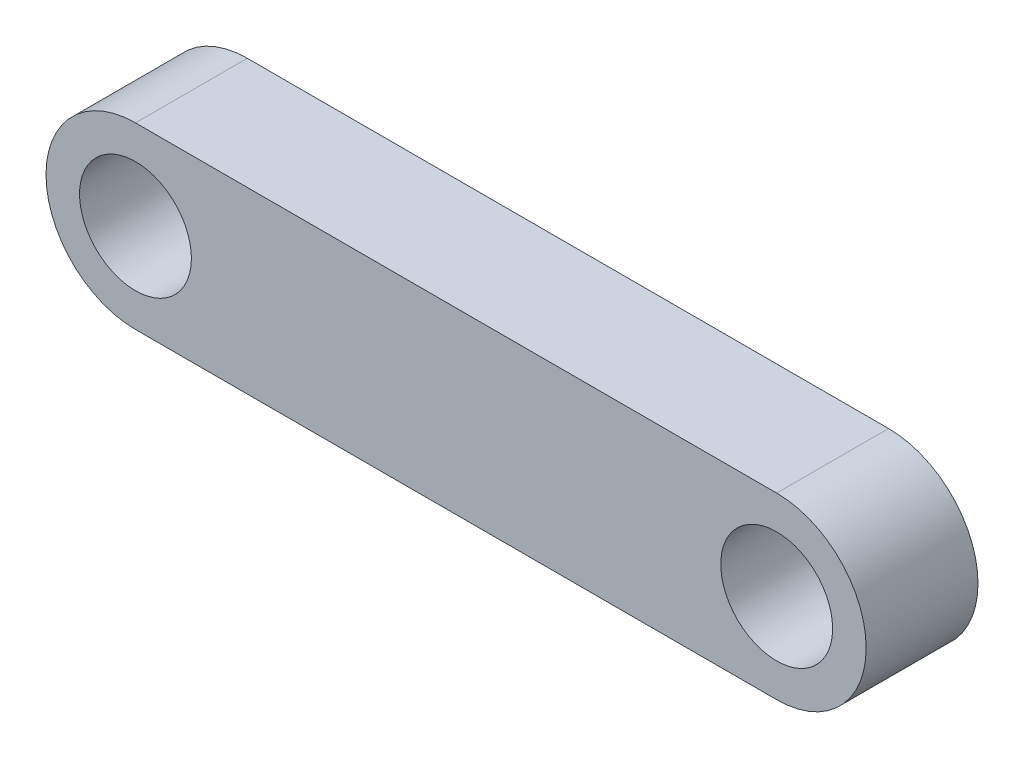
ISO-10303-21;
HEADER;
FILE_DESCRIPTION(('STEP AP214'),'2;1');
FILE_NAME('part.step','',(''),(''),'','','');
FILE_SCHEMA(('AUTOMOTIVE_DESIGN { 1 0 10303 214 1 1 1 1 }'));
ENDSEC;
DATA;
#1=APPLICATION_CONTEXT('core data for automotive mechanical design processes');
#2=APPLICATION_PROTOCOL_DEFINITION('international standard','automotive_design',2000,#1);
#3=PRODUCT_CONTEXT('',#1,'mechanical');
#4=PRODUCT('Part','Part','',(#3));
#5=PRODUCT_RELATED_PRODUCT_CATEGORY('part','',(#4));
#6=PRODUCT_DEFINITION_FORMATION('','',#4);
#7=PRODUCT_DEFINITION_CONTEXT('part definition',#1,'design');
#8=PRODUCT_DEFINITION('design','',#6,#7);
#9=PRODUCT_DEFINITION_SHAPE('','',#8);
#10=(LENGTH_UNIT() NAMED_UNIT(*) SI_UNIT(.MILLI.,.METRE.));
#11=(NAMED_UNIT(*) PLANE_ANGLE_UNIT() SI_UNIT($,.RADIAN.));
#12=(NAMED_UNIT(*) SI_UNIT($,.STERADIAN.) SOLID_ANGLE_UNIT());
#13=UNCERTAINTY_MEASURE_WITH_UNIT(LENGTH_MEASURE(1.E-05),#10,'distance_accuracy_value','');
#14=(GEOMETRIC_REPRESENTATION_CONTEXT(3) GLOBAL_UNCERTAINTY_ASSIGNED_CONTEXT((#13)) GLOBAL_UNIT_ASSIGNED_CONTEXT((#10,
#11,#12)) REPRESENTATION_CONTEXT('',''));
#15=CARTESIAN_POINT('',(0.,0.,0.));
#16=DIRECTION('',(0.,0.,1.));
#17=DIRECTION('',(1.,0.,0.));
#18=AXIS2_PLACEMENT_3D('',#15,#16,#17);
#19=CARTESIAN_POINT('',(-19.3325626510137,33.7870930752289,3.));
#20=DIRECTION('',(0.,0.,1.));
#21=DIRECTION('',(1.,0.,0.));
#22=AXIS2_PLACEMENT_3D('',#19,#20,#21);
#23=PLANE('',#22);
#24=CARTESIAN_POINT('',(-19.3325626510137,33.7870930752289,3.));
#25=DIRECTION('',(0.,0.,1.));
#26=DIRECTION('',(1.,0.,0.));
#27=AXIS2_PLACEMENT_3D('',#24,#25,#26);
#28=CIRCLE('',#27,1.5);
#29=CARTESIAN_POINT('',(-17.8325626510137,33.7870930752289,3.));
#30=VERTEX_POINT('',#29);
#31=EDGE_CURVE('E106',#30,#30,#28,.T.);
#32=ORIENTED_EDGE('',*,*,#31,.F.);
#33=EDGE_LOOP('',(#32));
#34=FACE_BOUND('',#33,.T.);
#35=CARTESIAN_POINT('',(-19.3325626510137,33.7870930752289,3.));
#36=DIRECTION('',(0.,0.,1.));
#37=DIRECTION('',(1.,0.,0.));
#38=AXIS2_PLACEMENT_3D('',#35,#36,#37);
#39=CIRCLE('',#38,2.4);
#40=CARTESIAN_POINT('',(-19.3325626510137,36.1870930752289,3.));
#41=VERTEX_POINT('',#40);
#42=CARTESIAN_POINT('',(-19.3325626510137,31.3870930752289,3.));
#43=VERTEX_POINT('',#42);
#44=EDGE_CURVE('E91',#41,#43,#39,.T.);
#45=ORIENTED_EDGE('',*,*,#44,.T.);
#46=DIRECTION('',(1.,0.,0.));
#47=VECTOR('',#46,1.);
#48=CARTESIAN_POINT('',(-19.3325626510137,31.3870930752289,3.));
#49=LINE('',#48,#47);
#50=CARTESIAN_POINT('',(-2.13290124671727,31.3870930752289,3.));
#51=VERTEX_POINT('',#50);
#52=EDGE_CURVE('E86',#43,#51,#49,.T.);
#53=ORIENTED_EDGE('',*,*,#52,.T.);
#54=CARTESIAN_POINT('',(-2.13290124671726,33.7870930752289,3.));
#55=DIRECTION('',(0.,0.,1.));
#56=DIRECTION('',(1.,0.,0.));
#57=AXIS2_PLACEMENT_3D('',#54,#55,#56);
#58=CIRCLE('',#57,2.4);
#59=CARTESIAN_POINT('',(-2.13290124671727,36.1870930752289,3.));
#60=VERTEX_POINT('',#59);
#61=EDGE_CURVE('E89',#51,#60,#58,.T.);
#62=ORIENTED_EDGE('',*,*,#61,.T.);
#63=DIRECTION('',(-1.,0.,0.));
#64=VECTOR('',#63,1.);
#65=CARTESIAN_POINT('',(-19.3325626510137,36.1870930752289,3.));
#66=LINE('',#65,#64);
#67=EDGE_CURVE('E56',#60,#41,#66,.T.);
#68=ORIENTED_EDGE('',*,*,#67,.T.);
#69=EDGE_LOOP('',(#45,#53,#62,#68));
#70=FACE_BOUND('',#69,.T.);
#71=CARTESIAN_POINT('',(-2.13290124671726,33.7870930752289,3.));
#72=DIRECTION('',(0.,0.,1.));
#73=DIRECTION('',(1.,0.,0.));
#74=AXIS2_PLACEMENT_3D('',#71,#72,#73);
#75=CIRCLE('',#74,1.5);
#76=CARTESIAN_POINT('',(-0.632901246717259,33.7870930752289,3.));
#77=VERTEX_POINT('',#76);
#78=EDGE_CURVE('E121',#77,#77,#75,.T.);
#79=ORIENTED_EDGE('',*,*,#78,.F.);
#80=EDGE_LOOP('',(#79));
#81=FACE_BOUND('',#80,.T.);
#82=ADVANCED_FACE('F39',(#34,#70,#81),#23,.T.);
#83=CARTESIAN_POINT('',(-19.3325626510137,33.7870930752289,0.));
#84=DIRECTION('',(0.,0.,1.));
#85=DIRECTION('',(1.,0.,0.));
#86=AXIS2_PLACEMENT_3D('',#83,#84,#85);
#87=PLANE('',#86);
#88=CARTESIAN_POINT('',(-19.3325626510137,33.7870930752289,0.));
#89=DIRECTION('',(0.,0.,1.));
#90=DIRECTION('',(1.,0.,0.));
#91=AXIS2_PLACEMENT_3D('',#88,#89,#90);
#92=CIRCLE('',#91,1.5);
#93=CARTESIAN_POINT('',(-17.8325626510137,33.7870930752289,0.));
#94=VERTEX_POINT('',#93);
#95=EDGE_CURVE('E118',#94,#94,#92,.T.);
#96=ORIENTED_EDGE('',*,*,#95,.T.);
#97=EDGE_LOOP('',(#96));
#98=FACE_BOUND('',#97,.T.);
#99=CARTESIAN_POINT('',(-19.3325626510137,33.7870930752289,0.));
#100=DIRECTION('',(0.,0.,1.));
#101=DIRECTION('',(1.,0.,0.));
#102=AXIS2_PLACEMENT_3D('',#99,#100,#101);
#103=CIRCLE('',#102,2.4);
#104=CARTESIAN_POINT('',(-19.3325626510137,36.1870930752289,0.));
#105=VERTEX_POINT('',#104);
#106=CARTESIAN_POINT('',(-19.3325626510137,31.3870930752289,0.));
#107=VERTEX_POINT('',#106);
#108=EDGE_CURVE('E103',#105,#107,#103,.T.);
#109=ORIENTED_EDGE('',*,*,#108,.F.);
#110=DIRECTION('',(-1.,0.,0.));
#111=VECTOR('',#110,1.);
#112=CARTESIAN_POINT('',(-19.3325626510137,36.1870930752289,0.));
#113=LINE('',#112,#111);
#114=CARTESIAN_POINT('',(-2.13290124671727,36.1870930752289,0.));
#115=VERTEX_POINT('',#114);
#116=EDGE_CURVE('E79',#115,#105,#113,.T.);
#117=ORIENTED_EDGE('',*,*,#116,.F.);
#118=CARTESIAN_POINT('',(-2.13290124671726,33.7870930752289,0.));
#119=DIRECTION('',(0.,0.,1.));
#120=DIRECTION('',(1.,0.,0.));
#121=AXIS2_PLACEMENT_3D('',#118,#119,#120);
#122=CIRCLE('',#121,2.4);
#123=CARTESIAN_POINT('',(-2.13290124671727,31.3870930752289,0.));
#124=VERTEX_POINT('',#123);
#125=EDGE_CURVE('E73',#124,#115,#122,.T.);
#126=ORIENTED_EDGE('',*,*,#125,.F.);
#127=DIRECTION('',(1.,0.,0.));
#128=VECTOR('',#127,1.);
#129=CARTESIAN_POINT('',(-19.3325626510137,31.3870930752289,0.));
#130=LINE('',#129,#128);
#131=EDGE_CURVE('E95',#107,#124,#130,.T.);
#132=ORIENTED_EDGE('',*,*,#131,.F.);
#133=EDGE_LOOP('',(#109,#117,#126,#132));
#134=FACE_BOUND('',#133,.T.);
#135=CARTESIAN_POINT('',(-2.13290124671726,33.7870930752289,0.));
#136=DIRECTION('',(0.,0.,1.));
#137=DIRECTION('',(1.,0.,0.));
#138=AXIS2_PLACEMENT_3D('',#135,#136,#137);
#139=CIRCLE('',#138,1.5);
#140=CARTESIAN_POINT('',(-0.632901246717259,33.7870930752289,0.));
#141=VERTEX_POINT('',#140);
#142=EDGE_CURVE('E124',#141,#141,#139,.T.);
#143=ORIENTED_EDGE('',*,*,#142,.T.);
#144=EDGE_LOOP('',(#143));
#145=FACE_BOUND('',#144,.T.);
#146=ADVANCED_FACE('F114',(#98,#134,#145),#87,.F.);
#147=CARTESIAN_POINT('',(-19.3325626510137,33.7870930752289,3.));
#148=DIRECTION('',(0.,0.,-1.));
#149=DIRECTION('',(-1.,0.,0.));
#150=AXIS2_PLACEMENT_3D('',#147,#148,#149);
#151=CYLINDRICAL_SURFACE('',#150,2.4);
#152=ORIENTED_EDGE('',*,*,#108,.T.);
#153=DIRECTION('',(0.,0.,-1.));
#154=VECTOR('',#153,1.);
#155=CARTESIAN_POINT('',(-19.3325626510137,31.3870930752289,3.));
#156=LINE('',#155,#154);
#157=EDGE_CURVE('E11',#43,#107,#156,.T.);
#158=ORIENTED_EDGE('',*,*,#157,.F.);
#159=ORIENTED_EDGE('',*,*,#44,.F.);
#160=DIRECTION('',(0.,0.,-1.));
#161=VECTOR('',#160,1.);
#162=CARTESIAN_POINT('',(-19.3325626510137,36.1870930752289,3.));
#163=LINE('',#162,#161);
#164=EDGE_CURVE('E99',#41,#105,#163,.T.);
#165=ORIENTED_EDGE('',*,*,#164,.T.);
#166=EDGE_LOOP('',(#152,#158,#159,#165));
#167=FACE_BOUND('',#166,.T.);
#168=ADVANCED_FACE('F41',(#167),#151,.T.);
#169=CARTESIAN_POINT('',(-19.3325626510137,31.3870930752289,3.));
#170=DIRECTION('',(0.,1.,0.));
#171=DIRECTION('',(0.,0.,1.));
#172=AXIS2_PLACEMENT_3D('',#169,#170,#171);
#173=PLANE('',#172);
#174=ORIENTED_EDGE('',*,*,#131,.T.);
#175=DIRECTION('',(0.,0.,-1.));
#176=VECTOR('',#175,1.);
#177=CARTESIAN_POINT('',(-2.13290124671727,31.3870930752289,3.));
#178=LINE('',#177,#176);
#179=EDGE_CURVE('E48',#51,#124,#178,.T.);
#180=ORIENTED_EDGE('',*,*,#179,.F.);
#181=ORIENTED_EDGE('',*,*,#52,.F.);
#182=ORIENTED_EDGE('',*,*,#157,.T.);
#183=EDGE_LOOP('',(#174,#180,#181,#182));
#184=FACE_BOUND('',#183,.T.);
#185=ADVANCED_FACE('F94',(#184),#173,.F.);
#186=CARTESIAN_POINT('',(-2.13290124671726,33.7870930752289,3.));
#187=DIRECTION('',(0.,0.,-1.));
#188=DIRECTION('',(-1.,0.,0.));
#189=AXIS2_PLACEMENT_3D('',#186,#187,#188);
#190=CYLINDRICAL_SURFACE('',#189,2.4);
#191=ORIENTED_EDGE('',*,*,#125,.T.);
#192=DIRECTION('',(0.,0.,-1.));
#193=VECTOR('',#192,1.);
#194=CARTESIAN_POINT('',(-2.13290124671727,36.1870930752289,3.));
#195=LINE('',#194,#193);
#196=EDGE_CURVE('E96',#60,#115,#195,.T.);
#197=ORIENTED_EDGE('',*,*,#196,.F.);
#198=ORIENTED_EDGE('',*,*,#61,.F.);
#199=ORIENTED_EDGE('',*,*,#179,.T.);
#200=EDGE_LOOP('',(#191,#197,#198,#199));
#201=FACE_BOUND('',#200,.T.);
#202=ADVANCED_FACE('F97',(#201),#190,.T.);
#203=CARTESIAN_POINT('',(-19.3325626510137,36.1870930752289,3.));
#204=DIRECTION('',(0.,-1.,0.));
#205=DIRECTION('',(0.,0.,-1.));
#206=AXIS2_PLACEMENT_3D('',#203,#204,#205);
#207=PLANE('',#206);
#208=ORIENTED_EDGE('',*,*,#116,.T.);
#209=ORIENTED_EDGE('',*,*,#164,.F.);
#210=ORIENTED_EDGE('',*,*,#67,.F.);
#211=ORIENTED_EDGE('',*,*,#196,.T.);
#212=EDGE_LOOP('',(#208,#209,#210,#211));
#213=FACE_BOUND('',#212,.T.);
#214=ADVANCED_FACE('F111',(#213),#207,.F.);
#215=CARTESIAN_POINT('',(-19.3325626510137,33.7870930752289,3.));
#216=DIRECTION('',(0.,0.,-1.));
#217=DIRECTION('',(-1.,0.,0.));
#218=AXIS2_PLACEMENT_3D('',#215,#216,#217);
#219=CYLINDRICAL_SURFACE('',#218,1.5);
#220=ORIENTED_EDGE('',*,*,#31,.T.);
#221=EDGE_LOOP('',(#220));
#222=FACE_BOUND('',#221,.T.);
#223=ORIENTED_EDGE('',*,*,#95,.F.);
#224=EDGE_LOOP('',(#223));
#225=FACE_BOUND('',#224,.T.);
#226=ADVANCED_FACE('F142',(#222,#225),#219,.F.);
#227=CARTESIAN_POINT('',(-2.13290124671726,33.7870930752289,3.));
#228=DIRECTION('',(0.,0.,-1.));
#229=DIRECTION('',(-1.,0.,0.));
#230=AXIS2_PLACEMENT_3D('',#227,#228,#229);
#231=CYLINDRICAL_SURFACE('',#230,1.5);
#232=ORIENTED_EDGE('',*,*,#78,.T.);
#233=EDGE_LOOP('',(#232));
#234=FACE_BOUND('',#233,.T.);
#235=ORIENTED_EDGE('',*,*,#142,.F.);
#236=EDGE_LOOP('',(#235));
#237=FACE_BOUND('',#236,.T.);
#238=ADVANCED_FACE('F130',(#234,#237),#231,.F.);
#239=CLOSED_SHELL('',(#82,#146,#168,#185,#202,#214,#226,#238));
#240=MANIFOLD_SOLID_BREP('B2',#239);
#241=ADVANCED_BREP_SHAPE_REPRESENTATION('',(#18,#240),#14);
#242=SHAPE_DEFINITION_REPRESENTATION(#9,#241);
ENDSEC;
END-ISO-10303-21;
